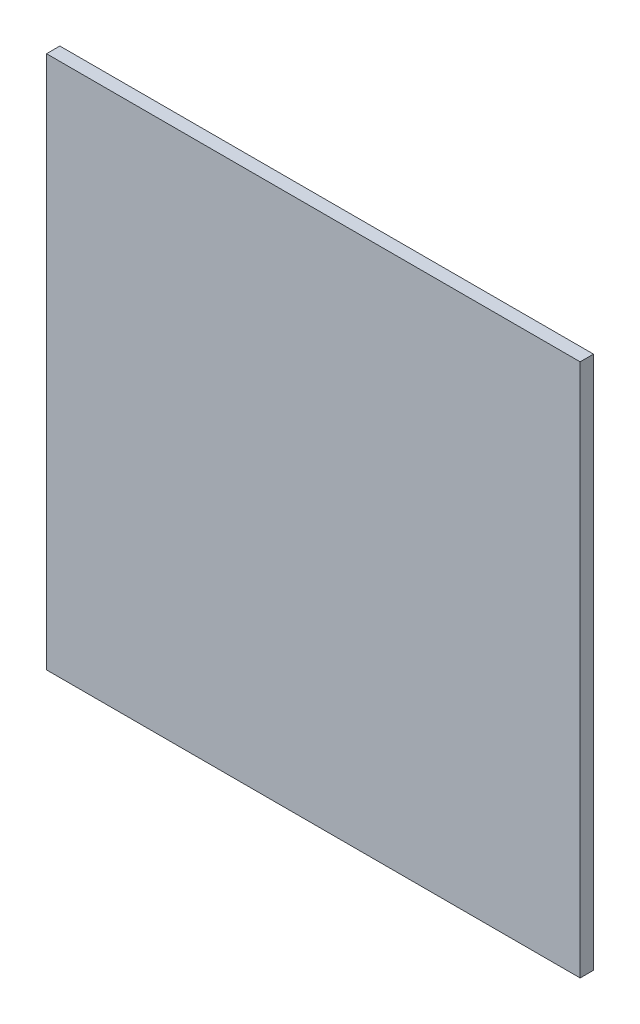
ISO-10303-21;
HEADER;
FILE_DESCRIPTION(('STEP AP214'),'2;1');
FILE_NAME('part.step','',(''),(''),'','','');
FILE_SCHEMA(('AUTOMOTIVE_DESIGN { 1 0 10303 214 1 1 1 1 }'));
ENDSEC;
DATA;
#1=APPLICATION_CONTEXT('core data for automotive mechanical design processes');
#2=APPLICATION_PROTOCOL_DEFINITION('international standard','automotive_design',2000,#1);
#3=PRODUCT_CONTEXT('',#1,'mechanical');
#4=PRODUCT('Part','Part','',(#3));
#5=PRODUCT_RELATED_PRODUCT_CATEGORY('part','',(#4));
#6=PRODUCT_DEFINITION_FORMATION('','',#4);
#7=PRODUCT_DEFINITION_CONTEXT('part definition',#1,'design');
#8=PRODUCT_DEFINITION('design','',#6,#7);
#9=PRODUCT_DEFINITION_SHAPE('','',#8);
#10=(LENGTH_UNIT() NAMED_UNIT(*) SI_UNIT(.MILLI.,.METRE.));
#11=(NAMED_UNIT(*) PLANE_ANGLE_UNIT() SI_UNIT($,.RADIAN.));
#12=(NAMED_UNIT(*) SI_UNIT($,.STERADIAN.) SOLID_ANGLE_UNIT());
#13=UNCERTAINTY_MEASURE_WITH_UNIT(LENGTH_MEASURE(1.E-05),#10,'distance_accuracy_value','');
#14=(GEOMETRIC_REPRESENTATION_CONTEXT(3) GLOBAL_UNCERTAINTY_ASSIGNED_CONTEXT((#13)) GLOBAL_UNIT_ASSIGNED_CONTEXT((#10,
#11,#12)) REPRESENTATION_CONTEXT('',''));
#15=CARTESIAN_POINT('',(0.,0.,0.));
#16=DIRECTION('',(0.,0.,1.));
#17=DIRECTION('',(1.,0.,0.));
#18=AXIS2_PLACEMENT_3D('',#15,#16,#17);
#19=CARTESIAN_POINT('',(-0.2,-0.2,0.01));
#20=DIRECTION('',(1.,0.,0.));
#21=DIRECTION('',(0.,0.,-1.));
#22=AXIS2_PLACEMENT_3D('',#19,#20,#21);
#23=PLANE('',#22);
#24=DIRECTION('',(0.,-1.,0.));
#25=VECTOR('',#24,1.);
#26=CARTESIAN_POINT('',(-0.2,-0.2,0.));
#27=LINE('',#26,#25);
#28=CARTESIAN_POINT('',(-0.2,0.2,0.));
#29=VERTEX_POINT('',#28);
#30=CARTESIAN_POINT('',(-0.2,-0.2,0.));
#31=VERTEX_POINT('',#30);
#32=EDGE_CURVE('E96',#29,#31,#27,.T.);
#33=ORIENTED_EDGE('',*,*,#32,.T.);
#34=DIRECTION('',(0.,0.,-1.));
#35=VECTOR('',#34,1.);
#36=CARTESIAN_POINT('',(-0.2,-0.2,0.01));
#37=LINE('',#36,#35);
#38=CARTESIAN_POINT('',(-0.2,-0.2,0.01));
#39=VERTEX_POINT('',#38);
#40=EDGE_CURVE('E11',#39,#31,#37,.T.);
#41=ORIENTED_EDGE('',*,*,#40,.F.);
#42=DIRECTION('',(0.,-1.,0.));
#43=VECTOR('',#42,1.);
#44=CARTESIAN_POINT('',(-0.2,-0.2,0.01));
#45=LINE('',#44,#43);
#46=CARTESIAN_POINT('',(-0.2,0.2,0.01));
#47=VERTEX_POINT('',#46);
#48=EDGE_CURVE('E84',#47,#39,#45,.T.);
#49=ORIENTED_EDGE('',*,*,#48,.F.);
#50=DIRECTION('',(0.,0.,-1.));
#51=VECTOR('',#50,1.);
#52=CARTESIAN_POINT('',(-0.2,0.2,0.01));
#53=LINE('',#52,#51);
#54=EDGE_CURVE('E92',#47,#29,#53,.T.);
#55=ORIENTED_EDGE('',*,*,#54,.T.);
#56=EDGE_LOOP('',(#33,#41,#49,#55));
#57=FACE_BOUND('',#56,.T.);
#58=ADVANCED_FACE('F33',(#57),#23,.F.);
#59=CARTESIAN_POINT('',(-0.2,-0.2,0.01));
#60=DIRECTION('',(0.,1.,0.));
#61=DIRECTION('',(0.,0.,1.));
#62=AXIS2_PLACEMENT_3D('',#59,#60,#61);
#63=PLANE('',#62);
#64=DIRECTION('',(1.,0.,0.));
#65=VECTOR('',#64,1.);
#66=CARTESIAN_POINT('',(-0.2,-0.2,0.));
#67=LINE('',#66,#65);
#68=CARTESIAN_POINT('',(0.2,-0.2,0.));
#69=VERTEX_POINT('',#68);
#70=EDGE_CURVE('E88',#31,#69,#67,.T.);
#71=ORIENTED_EDGE('',*,*,#70,.T.);
#72=DIRECTION('',(0.,0.,-1.));
#73=VECTOR('',#72,1.);
#74=CARTESIAN_POINT('',(0.2,-0.2,0.01));
#75=LINE('',#74,#73);
#76=CARTESIAN_POINT('',(0.2,-0.2,0.01));
#77=VERTEX_POINT('',#76);
#78=EDGE_CURVE('E41',#77,#69,#75,.T.);
#79=ORIENTED_EDGE('',*,*,#78,.F.);
#80=DIRECTION('',(1.,0.,0.));
#81=VECTOR('',#80,1.);
#82=CARTESIAN_POINT('',(-0.2,-0.2,0.01));
#83=LINE('',#82,#81);
#84=EDGE_CURVE('E79',#39,#77,#83,.T.);
#85=ORIENTED_EDGE('',*,*,#84,.F.);
#86=ORIENTED_EDGE('',*,*,#40,.T.);
#87=EDGE_LOOP('',(#71,#79,#85,#86));
#88=FACE_BOUND('',#87,.T.);
#89=ADVANCED_FACE('F87',(#88),#63,.F.);
#90=CARTESIAN_POINT('',(0.2,-0.2,0.01));
#91=DIRECTION('',(-1.,0.,0.));
#92=DIRECTION('',(0.,0.,1.));
#93=AXIS2_PLACEMENT_3D('',#90,#91,#92);
#94=PLANE('',#93);
#95=DIRECTION('',(0.,1.,0.));
#96=VECTOR('',#95,1.);
#97=CARTESIAN_POINT('',(0.2,-0.2,0.));
#98=LINE('',#97,#96);
#99=CARTESIAN_POINT('',(0.2,0.2,0.));
#100=VERTEX_POINT('',#99);
#101=EDGE_CURVE('E66',#69,#100,#98,.T.);
#102=ORIENTED_EDGE('',*,*,#101,.T.);
#103=DIRECTION('',(0.,0.,-1.));
#104=VECTOR('',#103,1.);
#105=CARTESIAN_POINT('',(0.2,0.2,0.01));
#106=LINE('',#105,#104);
#107=CARTESIAN_POINT('',(0.2,0.2,0.01));
#108=VERTEX_POINT('',#107);
#109=EDGE_CURVE('E89',#108,#100,#106,.T.);
#110=ORIENTED_EDGE('',*,*,#109,.F.);
#111=DIRECTION('',(0.,1.,0.));
#112=VECTOR('',#111,1.);
#113=CARTESIAN_POINT('',(0.2,-0.2,0.01));
#114=LINE('',#113,#112);
#115=EDGE_CURVE('E82',#77,#108,#114,.T.);
#116=ORIENTED_EDGE('',*,*,#115,.F.);
#117=ORIENTED_EDGE('',*,*,#78,.T.);
#118=EDGE_LOOP('',(#102,#110,#116,#117));
#119=FACE_BOUND('',#118,.T.);
#120=ADVANCED_FACE('F90',(#119),#94,.F.);
#121=CARTESIAN_POINT('',(-0.2,0.2,0.01));
#122=DIRECTION('',(0.,-1.,0.));
#123=DIRECTION('',(0.,0.,-1.));
#124=AXIS2_PLACEMENT_3D('',#121,#122,#123);
#125=PLANE('',#124);
#126=DIRECTION('',(-1.,0.,0.));
#127=VECTOR('',#126,1.);
#128=CARTESIAN_POINT('',(-0.2,0.2,0.));
#129=LINE('',#128,#127);
#130=EDGE_CURVE('E72',#100,#29,#129,.T.);
#131=ORIENTED_EDGE('',*,*,#130,.T.);
#132=ORIENTED_EDGE('',*,*,#54,.F.);
#133=DIRECTION('',(-1.,0.,0.));
#134=VECTOR('',#133,1.);
#135=CARTESIAN_POINT('',(-0.2,0.2,0.01));
#136=LINE('',#135,#134);
#137=EDGE_CURVE('E49',#108,#47,#136,.T.);
#138=ORIENTED_EDGE('',*,*,#137,.F.);
#139=ORIENTED_EDGE('',*,*,#109,.T.);
#140=EDGE_LOOP('',(#131,#132,#138,#139));
#141=FACE_BOUND('',#140,.T.);
#142=ADVANCED_FACE('F103',(#141),#125,.F.);
#143=CARTESIAN_POINT('',(0.,0.,0.01));
#144=DIRECTION('',(0.,0.,-1.));
#145=DIRECTION('',(-1.,0.,0.));
#146=AXIS2_PLACEMENT_3D('',#143,#144,#145);
#147=PLANE('',#146);
#148=ORIENTED_EDGE('',*,*,#48,.T.);
#149=ORIENTED_EDGE('',*,*,#84,.T.);
#150=ORIENTED_EDGE('',*,*,#115,.T.);
#151=ORIENTED_EDGE('',*,*,#137,.T.);
#152=EDGE_LOOP('',(#148,#149,#150,#151));
#153=FACE_BOUND('',#152,.T.);
#154=ADVANCED_FACE('F80',(#153),#147,.F.);
#155=CARTESIAN_POINT('',(0.,0.,0.));
#156=DIRECTION('',(0.,0.,-1.));
#157=DIRECTION('',(-1.,0.,0.));
#158=AXIS2_PLACEMENT_3D('',#155,#156,#157);
#159=PLANE('',#158);
#160=ORIENTED_EDGE('',*,*,#32,.F.);
#161=ORIENTED_EDGE('',*,*,#130,.F.);
#162=ORIENTED_EDGE('',*,*,#101,.F.);
#163=ORIENTED_EDGE('',*,*,#70,.F.);
#164=EDGE_LOOP('',(#160,#161,#162,#163));
#165=FACE_BOUND('',#164,.T.);
#166=ADVANCED_FACE('F106',(#165),#159,.T.);
#167=CLOSED_SHELL('',(#58,#89,#120,#142,#154,#166));
#168=MANIFOLD_SOLID_BREP('B2',#167);
#169=ADVANCED_BREP_SHAPE_REPRESENTATION('',(#18,#168),#14);
#170=SHAPE_DEFINITION_REPRESENTATION(#9,#169);
ENDSEC;
END-ISO-10303-21;
